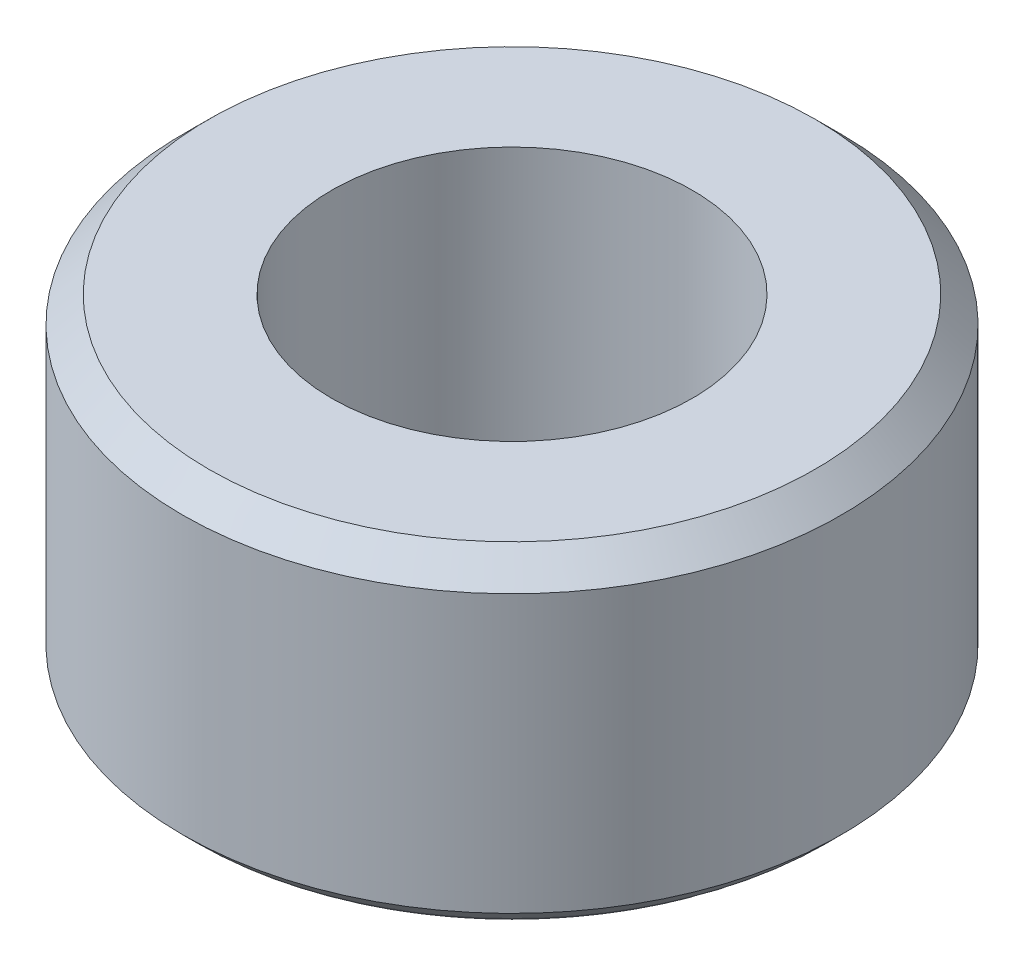
ISO-10303-21;
HEADER;
FILE_DESCRIPTION(('STEP AP214'),'2;1');
FILE_NAME('part.step','',(''),(''),'','','');
FILE_SCHEMA(('AUTOMOTIVE_DESIGN { 1 0 10303 214 1 1 1 1 }'));
ENDSEC;
DATA;
#1=APPLICATION_CONTEXT('core data for automotive mechanical design processes');
#2=APPLICATION_PROTOCOL_DEFINITION('international standard','automotive_design',2000,#1);
#3=PRODUCT_CONTEXT('',#1,'mechanical');
#4=PRODUCT('Part','Part','',(#3));
#5=PRODUCT_RELATED_PRODUCT_CATEGORY('part','',(#4));
#6=PRODUCT_DEFINITION_FORMATION('','',#4);
#7=PRODUCT_DEFINITION_CONTEXT('part definition',#1,'design');
#8=PRODUCT_DEFINITION('design','',#6,#7);
#9=PRODUCT_DEFINITION_SHAPE('','',#8);
#10=(LENGTH_UNIT() NAMED_UNIT(*) SI_UNIT(.MILLI.,.METRE.));
#11=(NAMED_UNIT(*) PLANE_ANGLE_UNIT() SI_UNIT($,.RADIAN.));
#12=(NAMED_UNIT(*) SI_UNIT($,.STERADIAN.) SOLID_ANGLE_UNIT());
#13=UNCERTAINTY_MEASURE_WITH_UNIT(LENGTH_MEASURE(1.E-05),#10,'distance_accuracy_value','');
#14=(GEOMETRIC_REPRESENTATION_CONTEXT(3) GLOBAL_UNCERTAINTY_ASSIGNED_CONTEXT((#13)) GLOBAL_UNIT_ASSIGNED_CONTEXT((#10,
#11,#12)) REPRESENTATION_CONTEXT('',''));
#15=CARTESIAN_POINT('',(0.,0.,0.));
#16=DIRECTION('',(0.,0.,1.));
#17=DIRECTION('',(1.,0.,0.));
#18=AXIS2_PLACEMENT_3D('',#15,#16,#17);
#19=CARTESIAN_POINT('',(0.,6.35,0.));
#20=DIRECTION('',(0.,-1.,0.));
#21=DIRECTION('',(0.,0.,-1.));
#22=AXIS2_PLACEMENT_3D('',#19,#20,#21);
#23=CYLINDRICAL_SURFACE('',#22,6.35);
#24=CARTESIAN_POINT('',(0.,0.507999999999999,0.));
#25=DIRECTION('',(0.,1.,0.));
#26=DIRECTION('',(0.,0.,1.));
#27=AXIS2_PLACEMENT_3D('',#24,#25,#26);
#28=CIRCLE('',#27,6.35);
#29=CARTESIAN_POINT('',(0.,0.507999999999999,6.35));
#30=VERTEX_POINT('',#29);
#31=EDGE_CURVE('E46',#30,#30,#28,.T.);
#32=ORIENTED_EDGE('',*,*,#31,.T.);
#33=EDGE_LOOP('',(#32));
#34=FACE_BOUND('',#33,.T.);
#35=CARTESIAN_POINT('',(0.,5.84199999999999,0.));
#36=DIRECTION('',(0.,1.,0.));
#37=DIRECTION('',(0.,0.,1.));
#38=AXIS2_PLACEMENT_3D('',#35,#36,#37);
#39=CIRCLE('',#38,6.35);
#40=CARTESIAN_POINT('',(0.,5.84199999999999,6.35));
#41=VERTEX_POINT('',#40);
#42=EDGE_CURVE('E51',#41,#41,#39,.F.);
#43=ORIENTED_EDGE('',*,*,#42,.T.);
#44=EDGE_LOOP('',(#43));
#45=FACE_BOUND('',#44,.T.);
#46=ADVANCED_FACE('F31',(#34,#45),#23,.T.);
#47=CARTESIAN_POINT('',(0.,6.35,0.));
#48=DIRECTION('',(0.,1.,0.));
#49=DIRECTION('',(0.,0.,1.));
#50=AXIS2_PLACEMENT_3D('',#47,#48,#49);
#51=PLANE('',#50);
#52=CARTESIAN_POINT('',(0.,6.35,0.));
#53=DIRECTION('',(0.,1.,0.));
#54=DIRECTION('',(0.,0.,1.));
#55=AXIS2_PLACEMENT_3D('',#52,#53,#54);
#56=CIRCLE('',#55,5.842);
#57=CARTESIAN_POINT('',(0.,6.35,5.842));
#58=VERTEX_POINT('',#57);
#59=EDGE_CURVE('E42',#58,#58,#56,.T.);
#60=ORIENTED_EDGE('',*,*,#59,.T.);
#61=EDGE_LOOP('',(#60));
#62=FACE_BOUND('',#61,.T.);
#63=CARTESIAN_POINT('',(0.,6.35,0.));
#64=DIRECTION('',(0.,1.,0.));
#65=DIRECTION('',(0.,0.,1.));
#66=AXIS2_PLACEMENT_3D('',#63,#64,#65);
#67=CIRCLE('',#66,3.475000035);
#68=CARTESIAN_POINT('',(0.,6.35,3.475000035));
#69=VERTEX_POINT('',#68);
#70=EDGE_CURVE('E57',#69,#69,#67,.T.);
#71=ORIENTED_EDGE('',*,*,#70,.F.);
#72=EDGE_LOOP('',(#71));
#73=FACE_BOUND('',#72,.T.);
#74=ADVANCED_FACE('F63',(#62,#73),#51,.T.);
#75=CARTESIAN_POINT('',(0.,0.,0.));
#76=DIRECTION('',(0.,1.,0.));
#77=DIRECTION('',(0.,0.,1.));
#78=AXIS2_PLACEMENT_3D('',#75,#76,#77);
#79=PLANE('',#78);
#80=CARTESIAN_POINT('',(0.,0.,0.));
#81=DIRECTION('',(0.,1.,0.));
#82=DIRECTION('',(0.,0.,1.));
#83=AXIS2_PLACEMENT_3D('',#80,#81,#82);
#84=CIRCLE('',#83,5.52719769259645);
#85=CARTESIAN_POINT('',(0.,0.,5.52719769259645));
#86=VERTEX_POINT('',#85);
#87=EDGE_CURVE('E38',#86,#86,#84,.F.);
#88=ORIENTED_EDGE('',*,*,#87,.T.);
#89=EDGE_LOOP('',(#88));
#90=FACE_BOUND('',#89,.T.);
#91=CARTESIAN_POINT('',(0.,0.,0.));
#92=DIRECTION('',(0.,1.,0.));
#93=DIRECTION('',(0.,0.,1.));
#94=AXIS2_PLACEMENT_3D('',#91,#92,#93);
#95=CIRCLE('',#94,3.475000035);
#96=CARTESIAN_POINT('',(0.,0.,3.475000035));
#97=VERTEX_POINT('',#96);
#98=EDGE_CURVE('E54',#97,#97,#95,.T.);
#99=ORIENTED_EDGE('',*,*,#98,.T.);
#100=EDGE_LOOP('',(#99));
#101=FACE_BOUND('',#100,.T.);
#102=ADVANCED_FACE('F65',(#90,#101),#79,.F.);
#103=CARTESIAN_POINT('',(0.,6.35,0.));
#104=DIRECTION('',(0.,1.,0.));
#105=DIRECTION('',(0.,0.,1.));
#106=AXIS2_PLACEMENT_3D('',#103,#104,#105);
#107=CYLINDRICAL_SURFACE('',#106,3.475000035);
#108=ORIENTED_EDGE('',*,*,#98,.F.);
#109=EDGE_LOOP('',(#108));
#110=FACE_BOUND('',#109,.T.);
#111=ORIENTED_EDGE('',*,*,#70,.T.);
#112=EDGE_LOOP('',(#111));
#113=FACE_BOUND('',#112,.T.);
#114=ADVANCED_FACE('F61',(#110,#113),#107,.F.);
#115=CARTESIAN_POINT('',(0.,0.507999999999999,0.));
#116=DIRECTION('',(0.,1.,0.));
#117=DIRECTION('',(0.,0.,1.));
#118=AXIS2_PLACEMENT_3D('',#115,#116,#117);
#119=CONICAL_SURFACE('',#118,6.35,0.785398163397451);
#120=CARTESIAN_POINT('',(0.,0.222598846298223,0.));
#121=DIRECTION('',(0.,1.,0.));
#122=DIRECTION('',(0.,0.,1.));
#123=AXIS2_PLACEMENT_3D('',#120,#121,#122);
#124=CIRCLE('',#123,6.06459884629822);
#125=CARTESIAN_POINT('',(0.,0.222598846298223,6.06459884629822));
#126=VERTEX_POINT('',#125);
#127=EDGE_CURVE('E10',#126,#126,#124,.T.);
#128=ORIENTED_EDGE('',*,*,#127,.T.);
#129=EDGE_LOOP('',(#128));
#130=FACE_BOUND('',#129,.T.);
#131=ORIENTED_EDGE('',*,*,#31,.F.);
#132=EDGE_LOOP('',(#131));
#133=FACE_BOUND('',#132,.T.);
#134=ADVANCED_FACE('F77',(#130,#133),#119,.T.);
#135=CARTESIAN_POINT('',(0.,6.35,0.));
#136=DIRECTION('',(0.,-1.,0.));
#137=DIRECTION('',(0.,0.,-1.));
#138=AXIS2_PLACEMENT_3D('',#135,#136,#137);
#139=CONICAL_SURFACE('',#138,5.842,0.785398163397444);
#140=ORIENTED_EDGE('',*,*,#42,.F.);
#141=EDGE_LOOP('',(#140));
#142=FACE_BOUND('',#141,.T.);
#143=ORIENTED_EDGE('',*,*,#59,.F.);
#144=EDGE_LOOP('',(#143));
#145=FACE_BOUND('',#144,.T.);
#146=ADVANCED_FACE('F79',(#142,#145),#139,.T.);
#147=CARTESIAN_POINT('',(0.,0.76,0.));
#148=DIRECTION('',(0.,1.,0.));
#149=DIRECTION('',(0.,0.,1.));
#150=AXIS2_PLACEMENT_3D('',#147,#148,#149);
#151=TOROIDAL_SURFACE('',#150,5.52719769259645,0.76);
#152=ORIENTED_EDGE('',*,*,#127,.F.);
#153=EDGE_LOOP('',(#152));
#154=FACE_BOUND('',#153,.T.);
#155=ORIENTED_EDGE('',*,*,#87,.F.);
#156=EDGE_LOOP('',(#155));
#157=FACE_BOUND('',#156,.T.);
#158=ADVANCED_FACE('F33',(#154,#157),#151,.T.);
#159=CLOSED_SHELL('',(#46,#74,#102,#114,#134,#146,#158));
#160=MANIFOLD_SOLID_BREP('B2',#159);
#161=ADVANCED_BREP_SHAPE_REPRESENTATION('',(#18,#160),#14);
#162=SHAPE_DEFINITION_REPRESENTATION(#9,#161);
ENDSEC;
END-ISO-10303-21;
